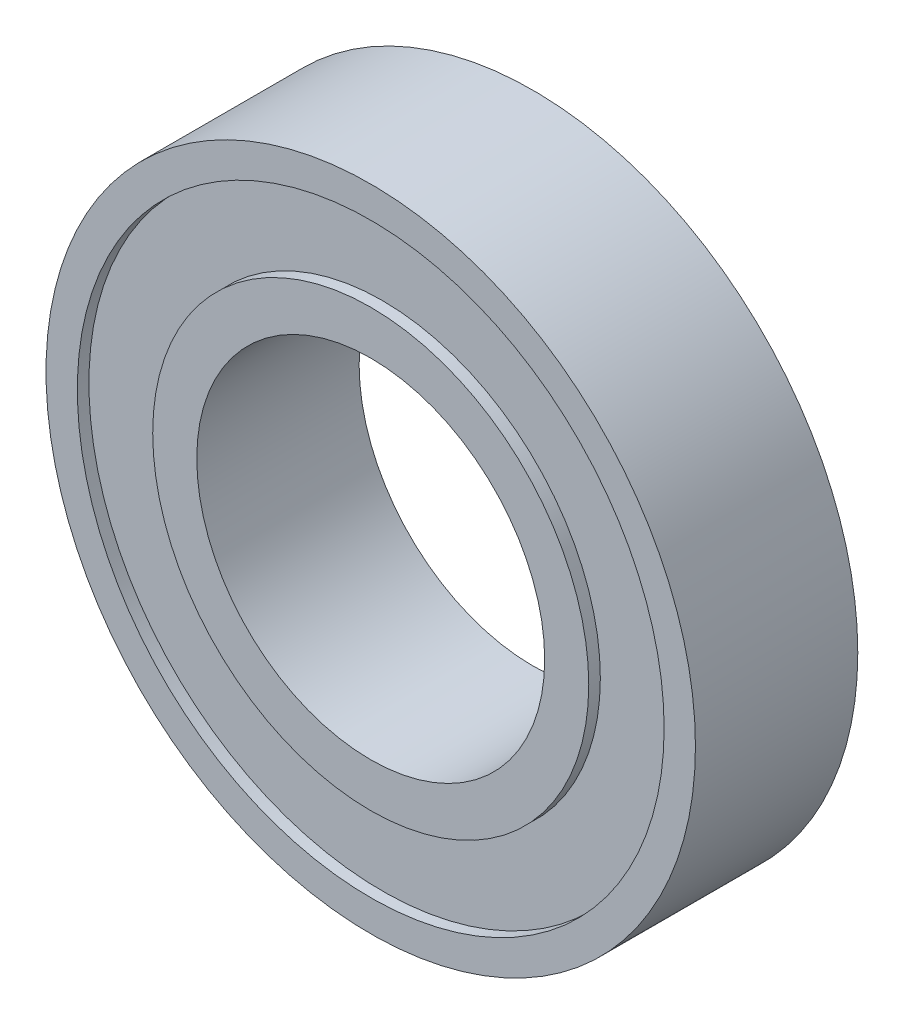
ISO-10303-21;
HEADER;
FILE_DESCRIPTION(('STEP AP214'),'2;1');
FILE_NAME('part.step','',(''),(''),'','','');
FILE_SCHEMA(('AUTOMOTIVE_DESIGN { 1 0 10303 214 1 1 1 1 }'));
ENDSEC;
DATA;
#1=APPLICATION_CONTEXT('core data for automotive mechanical design processes');
#2=APPLICATION_PROTOCOL_DEFINITION('international standard','automotive_design',2000,#1);
#3=PRODUCT_CONTEXT('',#1,'mechanical');
#4=PRODUCT('Part','Part','',(#3));
#5=PRODUCT_RELATED_PRODUCT_CATEGORY('part','',(#4));
#6=PRODUCT_DEFINITION_FORMATION('','',#4);
#7=PRODUCT_DEFINITION_CONTEXT('part definition',#1,'design');
#8=PRODUCT_DEFINITION('design','',#6,#7);
#9=PRODUCT_DEFINITION_SHAPE('','',#8);
#10=(LENGTH_UNIT() NAMED_UNIT(*) SI_UNIT(.MILLI.,.METRE.));
#11=(NAMED_UNIT(*) PLANE_ANGLE_UNIT() SI_UNIT($,.RADIAN.));
#12=(NAMED_UNIT(*) SI_UNIT($,.STERADIAN.) SOLID_ANGLE_UNIT());
#13=UNCERTAINTY_MEASURE_WITH_UNIT(LENGTH_MEASURE(1.E-05),#10,'distance_accuracy_value','');
#14=(GEOMETRIC_REPRESENTATION_CONTEXT(3) GLOBAL_UNCERTAINTY_ASSIGNED_CONTEXT((#13)) GLOBAL_UNIT_ASSIGNED_CONTEXT((#10,
#11,#12)) REPRESENTATION_CONTEXT('',''));
#15=CARTESIAN_POINT('',(0.,0.,0.));
#16=DIRECTION('',(0.,0.,1.));
#17=DIRECTION('',(1.,0.,0.));
#18=AXIS2_PLACEMENT_3D('',#15,#16,#17);
#19=CARTESIAN_POINT('',(0.,0.,0.));
#20=DIRECTION('',(0.,0.,1.));
#21=DIRECTION('',(1.,0.,0.));
#22=AXIS2_PLACEMENT_3D('',#19,#20,#21);
#23=PLANE('',#22);
#24=CARTESIAN_POINT('',(0.,0.,0.));
#25=DIRECTION('',(0.,0.,1.));
#26=DIRECTION('',(1.,0.,0.));
#27=AXIS2_PLACEMENT_3D('',#24,#25,#26);
#28=CIRCLE('',#27,7.5);
#29=CARTESIAN_POINT('',(7.5,0.,0.));
#30=VERTEX_POINT('',#29);
#31=EDGE_CURVE('E41',#30,#30,#28,.T.);
#32=ORIENTED_EDGE('',*,*,#31,.T.);
#33=EDGE_LOOP('',(#32));
#34=FACE_BOUND('',#33,.T.);
#35=CARTESIAN_POINT('',(0.,0.,0.));
#36=DIRECTION('',(0.,0.,-1.));
#37=DIRECTION('',(-1.,0.,0.));
#38=AXIS2_PLACEMENT_3D('',#35,#36,#37);
#39=CIRCLE('',#38,9.4);
#40=CARTESIAN_POINT('',(-9.4,0.,0.));
#41=VERTEX_POINT('',#40);
#42=EDGE_CURVE('E67',#41,#41,#39,.T.);
#43=ORIENTED_EDGE('',*,*,#42,.T.);
#44=EDGE_LOOP('',(#43));
#45=FACE_BOUND('',#44,.T.);
#46=ADVANCED_FACE('F30',(#34,#45),#23,.F.);
#47=CARTESIAN_POINT('',(0.,0.,7.));
#48=DIRECTION('',(0.,0.,1.));
#49=DIRECTION('',(1.,0.,0.));
#50=AXIS2_PLACEMENT_3D('',#47,#48,#49);
#51=PLANE('',#50);
#52=CARTESIAN_POINT('',(0.,0.,7.));
#53=DIRECTION('',(0.,0.,1.));
#54=DIRECTION('',(1.,0.,0.));
#55=AXIS2_PLACEMENT_3D('',#52,#53,#54);
#56=CIRCLE('',#55,7.5);
#57=CARTESIAN_POINT('',(7.5,0.,7.));
#58=VERTEX_POINT('',#57);
#59=EDGE_CURVE('E43',#58,#58,#56,.T.);
#60=ORIENTED_EDGE('',*,*,#59,.F.);
#61=EDGE_LOOP('',(#60));
#62=FACE_BOUND('',#61,.T.);
#63=CARTESIAN_POINT('',(0.,0.,7.));
#64=DIRECTION('',(0.,0.,1.));
#65=DIRECTION('',(1.,0.,0.));
#66=AXIS2_PLACEMENT_3D('',#63,#64,#65);
#67=CIRCLE('',#66,9.4);
#68=CARTESIAN_POINT('',(9.4,0.,7.));
#69=VERTEX_POINT('',#68);
#70=EDGE_CURVE('E55',#69,#69,#67,.T.);
#71=ORIENTED_EDGE('',*,*,#70,.T.);
#72=EDGE_LOOP('',(#71));
#73=FACE_BOUND('',#72,.T.);
#74=ADVANCED_FACE('F97',(#62,#73),#51,.T.);
#75=CARTESIAN_POINT('',(0.,0.,7.));
#76=DIRECTION('',(0.,0.,-1.));
#77=DIRECTION('',(-1.,0.,0.));
#78=AXIS2_PLACEMENT_3D('',#75,#76,#77);
#79=CYLINDRICAL_SURFACE('',#78,14.);
#80=CARTESIAN_POINT('',(0.,0.,7.));
#81=DIRECTION('',(0.,0.,1.));
#82=DIRECTION('',(1.,0.,0.));
#83=AXIS2_PLACEMENT_3D('',#80,#81,#82);
#84=CIRCLE('',#83,14.);
#85=CARTESIAN_POINT('',(14.,0.,7.));
#86=VERTEX_POINT('',#85);
#87=EDGE_CURVE('E10',#86,#86,#84,.T.);
#88=ORIENTED_EDGE('',*,*,#87,.F.);
#89=EDGE_LOOP('',(#88));
#90=FACE_BOUND('',#89,.T.);
#91=CARTESIAN_POINT('',(0.,0.,0.));
#92=DIRECTION('',(0.,0.,1.));
#93=DIRECTION('',(1.,0.,0.));
#94=AXIS2_PLACEMENT_3D('',#91,#92,#93);
#95=CIRCLE('',#94,14.);
#96=CARTESIAN_POINT('',(14.,0.,0.));
#97=VERTEX_POINT('',#96);
#98=EDGE_CURVE('E34',#97,#97,#95,.T.);
#99=ORIENTED_EDGE('',*,*,#98,.T.);
#100=EDGE_LOOP('',(#99));
#101=FACE_BOUND('',#100,.T.);
#102=ADVANCED_FACE('F32',(#90,#101),#79,.T.);
#103=CARTESIAN_POINT('',(0.,0.,7.));
#104=DIRECTION('',(0.,0.,1.));
#105=DIRECTION('',(1.,0.,0.));
#106=AXIS2_PLACEMENT_3D('',#103,#104,#105);
#107=CIRCLE('',#106,12.65);
#108=CARTESIAN_POINT('',(12.65,0.,7.));
#109=VERTEX_POINT('',#108);
#110=EDGE_CURVE('E49',#109,#109,#107,.T.);
#111=ORIENTED_EDGE('',*,*,#110,.F.);
#112=EDGE_LOOP('',(#111));
#113=FACE_BOUND('',#112,.T.);
#114=ORIENTED_EDGE('',*,*,#87,.T.);
#115=EDGE_LOOP('',(#114));
#116=FACE_BOUND('',#115,.T.);
#117=ADVANCED_FACE('F93',(#113,#116),#51,.T.);
#118=CARTESIAN_POINT('',(0.,0.,0.));
#119=DIRECTION('',(0.,0.,-1.));
#120=DIRECTION('',(-1.,0.,0.));
#121=AXIS2_PLACEMENT_3D('',#118,#119,#120);
#122=CIRCLE('',#121,12.65);
#123=CARTESIAN_POINT('',(-12.65,0.,0.));
#124=VERTEX_POINT('',#123);
#125=EDGE_CURVE('E61',#124,#124,#122,.T.);
#126=ORIENTED_EDGE('',*,*,#125,.F.);
#127=EDGE_LOOP('',(#126));
#128=FACE_BOUND('',#127,.T.);
#129=ORIENTED_EDGE('',*,*,#98,.F.);
#130=EDGE_LOOP('',(#129));
#131=FACE_BOUND('',#130,.T.);
#132=ADVANCED_FACE('F89',(#128,#131),#23,.F.);
#133=CARTESIAN_POINT('',(0.,0.,0.));
#134=DIRECTION('',(0.,0.,1.));
#135=DIRECTION('',(1.,0.,0.));
#136=AXIS2_PLACEMENT_3D('',#133,#134,#135);
#137=CYLINDRICAL_SURFACE('',#136,7.5);
#138=ORIENTED_EDGE('',*,*,#31,.F.);
#139=EDGE_LOOP('',(#138));
#140=FACE_BOUND('',#139,.T.);
#141=ORIENTED_EDGE('',*,*,#59,.T.);
#142=EDGE_LOOP('',(#141));
#143=FACE_BOUND('',#142,.T.);
#144=ADVANCED_FACE('F92',(#140,#143),#137,.F.);
#145=CARTESIAN_POINT('',(0.,0.,6.5));
#146=DIRECTION('',(0.,0.,1.));
#147=DIRECTION('',(1.,0.,0.));
#148=AXIS2_PLACEMENT_3D('',#145,#146,#147);
#149=CYLINDRICAL_SURFACE('',#148,12.65);
#150=CARTESIAN_POINT('',(0.,0.,6.5));
#151=DIRECTION('',(0.,0.,1.));
#152=DIRECTION('',(1.,0.,0.));
#153=AXIS2_PLACEMENT_3D('',#150,#151,#152);
#154=CIRCLE('',#153,12.65);
#155=CARTESIAN_POINT('',(12.65,0.,6.5));
#156=VERTEX_POINT('',#155);
#157=EDGE_CURVE('E46',#156,#156,#154,.T.);
#158=ORIENTED_EDGE('',*,*,#157,.F.);
#159=EDGE_LOOP('',(#158));
#160=FACE_BOUND('',#159,.T.);
#161=ORIENTED_EDGE('',*,*,#110,.T.);
#162=EDGE_LOOP('',(#161));
#163=FACE_BOUND('',#162,.T.);
#164=ADVANCED_FACE('F114',(#160,#163),#149,.F.);
#165=CARTESIAN_POINT('',(0.,0.,6.5));
#166=DIRECTION('',(0.,0.,1.));
#167=DIRECTION('',(1.,0.,0.));
#168=AXIS2_PLACEMENT_3D('',#165,#166,#167);
#169=PLANE('',#168);
#170=CARTESIAN_POINT('',(0.,0.,6.5));
#171=DIRECTION('',(0.,0.,1.));
#172=DIRECTION('',(1.,0.,0.));
#173=AXIS2_PLACEMENT_3D('',#170,#171,#172);
#174=CIRCLE('',#173,9.4);
#175=CARTESIAN_POINT('',(9.4,0.,6.5));
#176=VERTEX_POINT('',#175);
#177=EDGE_CURVE('E52',#176,#176,#174,.T.);
#178=ORIENTED_EDGE('',*,*,#177,.F.);
#179=EDGE_LOOP('',(#178));
#180=FACE_BOUND('',#179,.T.);
#181=ORIENTED_EDGE('',*,*,#157,.T.);
#182=EDGE_LOOP('',(#181));
#183=FACE_BOUND('',#182,.T.);
#184=ADVANCED_FACE('F118',(#180,#183),#169,.T.);
#185=CARTESIAN_POINT('',(0.,0.,6.5));
#186=DIRECTION('',(0.,0.,1.));
#187=DIRECTION('',(1.,0.,0.));
#188=AXIS2_PLACEMENT_3D('',#185,#186,#187);
#189=CYLINDRICAL_SURFACE('',#188,9.4);
#190=ORIENTED_EDGE('',*,*,#177,.T.);
#191=EDGE_LOOP('',(#190));
#192=FACE_BOUND('',#191,.T.);
#193=ORIENTED_EDGE('',*,*,#70,.F.);
#194=EDGE_LOOP('',(#193));
#195=FACE_BOUND('',#194,.T.);
#196=ADVANCED_FACE('F85',(#192,#195),#189,.T.);
#197=CARTESIAN_POINT('',(0.,0.,0.5));
#198=DIRECTION('',(0.,0.,-1.));
#199=DIRECTION('',(-1.,0.,0.));
#200=AXIS2_PLACEMENT_3D('',#197,#198,#199);
#201=CYLINDRICAL_SURFACE('',#200,12.65);
#202=CARTESIAN_POINT('',(0.,0.,0.5));
#203=DIRECTION('',(0.,0.,-1.));
#204=DIRECTION('',(-1.,0.,0.));
#205=AXIS2_PLACEMENT_3D('',#202,#203,#204);
#206=CIRCLE('',#205,12.65);
#207=CARTESIAN_POINT('',(-12.65,0.,0.5));
#208=VERTEX_POINT('',#207);
#209=EDGE_CURVE('E58',#208,#208,#206,.T.);
#210=ORIENTED_EDGE('',*,*,#209,.F.);
#211=EDGE_LOOP('',(#210));
#212=FACE_BOUND('',#211,.T.);
#213=ORIENTED_EDGE('',*,*,#125,.T.);
#214=EDGE_LOOP('',(#213));
#215=FACE_BOUND('',#214,.T.);
#216=ADVANCED_FACE('F79',(#212,#215),#201,.F.);
#217=CARTESIAN_POINT('',(0.,0.,0.5));
#218=DIRECTION('',(0.,0.,-1.));
#219=DIRECTION('',(-1.,0.,0.));
#220=AXIS2_PLACEMENT_3D('',#217,#218,#219);
#221=PLANE('',#220);
#222=CARTESIAN_POINT('',(0.,0.,0.5));
#223=DIRECTION('',(0.,0.,-1.));
#224=DIRECTION('',(-1.,0.,0.));
#225=AXIS2_PLACEMENT_3D('',#222,#223,#224);
#226=CIRCLE('',#225,9.4);
#227=CARTESIAN_POINT('',(-9.4,0.,0.5));
#228=VERTEX_POINT('',#227);
#229=EDGE_CURVE('E64',#228,#228,#226,.T.);
#230=ORIENTED_EDGE('',*,*,#229,.F.);
#231=EDGE_LOOP('',(#230));
#232=FACE_BOUND('',#231,.T.);
#233=ORIENTED_EDGE('',*,*,#209,.T.);
#234=EDGE_LOOP('',(#233));
#235=FACE_BOUND('',#234,.T.);
#236=ADVANCED_FACE('F76',(#232,#235),#221,.T.);
#237=CARTESIAN_POINT('',(0.,0.,0.5));
#238=DIRECTION('',(0.,0.,-1.));
#239=DIRECTION('',(-1.,0.,0.));
#240=AXIS2_PLACEMENT_3D('',#237,#238,#239);
#241=CYLINDRICAL_SURFACE('',#240,9.4);
#242=ORIENTED_EDGE('',*,*,#229,.T.);
#243=EDGE_LOOP('',(#242));
#244=FACE_BOUND('',#243,.T.);
#245=ORIENTED_EDGE('',*,*,#42,.F.);
#246=EDGE_LOOP('',(#245));
#247=FACE_BOUND('',#246,.T.);
#248=ADVANCED_FACE('F73',(#244,#247),#241,.T.);
#249=CLOSED_SHELL('',(#46,#74,#102,#117,#132,#144,#164,#184,#196,#216,#236,#248));
#250=MANIFOLD_SOLID_BREP('B2',#249);
#251=ADVANCED_BREP_SHAPE_REPRESENTATION('',(#18,#250),#14);
#252=SHAPE_DEFINITION_REPRESENTATION(#9,#251);
ENDSEC;
END-ISO-10303-21;
